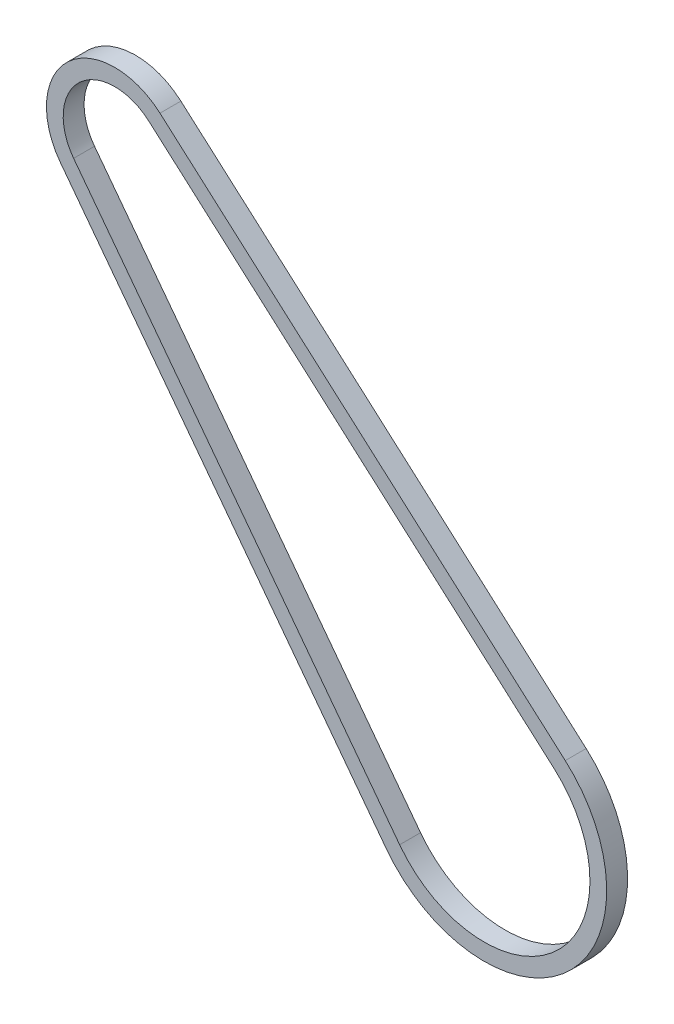
ISO-10303-21;
HEADER;
FILE_DESCRIPTION(('STEP AP214'),'2;1');
FILE_NAME('part.step','',(''),(''),'','','');
FILE_SCHEMA(('AUTOMOTIVE_DESIGN { 1 0 10303 214 1 1 1 1 }'));
ENDSEC;
DATA;
#1=APPLICATION_CONTEXT('core data for automotive mechanical design processes');
#2=APPLICATION_PROTOCOL_DEFINITION('international standard','automotive_design',2000,#1);
#3=PRODUCT_CONTEXT('',#1,'mechanical');
#4=PRODUCT('Part','Part','',(#3));
#5=PRODUCT_RELATED_PRODUCT_CATEGORY('part','',(#4));
#6=PRODUCT_DEFINITION_FORMATION('','',#4);
#7=PRODUCT_DEFINITION_CONTEXT('part definition',#1,'design');
#8=PRODUCT_DEFINITION('design','',#6,#7);
#9=PRODUCT_DEFINITION_SHAPE('','',#8);
#10=(LENGTH_UNIT() NAMED_UNIT(*) SI_UNIT(.MILLI.,.METRE.));
#11=(NAMED_UNIT(*) PLANE_ANGLE_UNIT() SI_UNIT($,.RADIAN.));
#12=(NAMED_UNIT(*) SI_UNIT($,.STERADIAN.) SOLID_ANGLE_UNIT());
#13=UNCERTAINTY_MEASURE_WITH_UNIT(LENGTH_MEASURE(1.E-05),#10,'distance_accuracy_value','');
#14=(GEOMETRIC_REPRESENTATION_CONTEXT(3) GLOBAL_UNCERTAINTY_ASSIGNED_CONTEXT((#13)) GLOBAL_UNIT_ASSIGNED_CONTEXT((#10,
#11,#12)) REPRESENTATION_CONTEXT('',''));
#15=CARTESIAN_POINT('',(0.,0.,0.));
#16=DIRECTION('',(0.,0.,1.));
#17=DIRECTION('',(1.,0.,0.));
#18=AXIS2_PLACEMENT_3D('',#15,#16,#17);
#19=CARTESIAN_POINT('',(-5.15972256683298,5.12057772172186,6.35));
#20=DIRECTION('',(0.,0.,1.));
#21=DIRECTION('',(1.,0.,0.));
#22=AXIS2_PLACEMENT_3D('',#19,#20,#21);
#23=PLANE('',#22);
#24=CARTESIAN_POINT('',(-5.15972256683298,5.12057772172186,6.35));
#25=DIRECTION('',(0.,0.,1.));
#26=DIRECTION('',(1.,0.,0.));
#27=AXIS2_PLACEMENT_3D('',#24,#25,#26);
#28=CIRCLE('',#27,37.236935850276);
#29=CARTESIAN_POINT('',(-34.8684238112249,-17.3289759907472,6.35));
#30=VERTEX_POINT('',#29);
#31=CARTESIAN_POINT('',(19.4938777779717,33.0273758461255,6.35));
#32=VERTEX_POINT('',#31);
#33=EDGE_CURVE('E134',#30,#32,#28,.T.);
#34=ORIENTED_EDGE('',*,*,#33,.T.);
#35=DIRECTION('',(-0.749438628264489,0.66207381949828,0.));
#36=VECTOR('',#35,1.);
#37=CARTESIAN_POINT('',(19.4938777779717,33.0273758461255,6.35));
#38=LINE('',#37,#36);
#39=CARTESIAN_POINT('',(-103.619658826307,141.789116084006,6.35));
#40=VERTEX_POINT('',#39);
#41=EDGE_CURVE('E137',#32,#40,#38,.T.);
#42=ORIENTED_EDGE('',*,*,#41,.T.);
#43=CARTESIAN_POINT('',(-117.355042285618,126.241262302031,6.35));
#44=DIRECTION('',(0.,0.,1.));
#45=DIRECTION('',(1.,0.,0.));
#46=AXIS2_PLACEMENT_3D('',#43,#44,#45);
#47=CIRCLE('',#46,20.746);
#48=CARTESIAN_POINT('',(-133.906799350011,113.733830348136,6.35));
#49=VERTEX_POINT('',#48);
#50=EDGE_CURVE('E140',#40,#49,#47,.T.);
#51=ORIENTED_EDGE('',*,*,#50,.T.);
#52=DIRECTION('',(0.602884023613954,-0.797828837577991,0.));
#53=VECTOR('',#52,1.);
#54=CARTESIAN_POINT('',(-34.8684238112249,-17.3289759907472,6.35));
#55=LINE('',#54,#53);
#56=EDGE_CURVE('E142',#49,#30,#55,.T.);
#57=ORIENTED_EDGE('',*,*,#56,.T.);
#58=EDGE_LOOP('',(#34,#42,#51,#57));
#59=FACE_BOUND('',#58,.T.);
#60=DIRECTION('',(-0.749438628264489,0.66207381949828,0.));
#61=VECTOR('',#60,1.);
#62=CARTESIAN_POINT('',(16.1305427749204,29.2202276145419,6.35));
#63=LINE('',#62,#61);
#64=CARTESIAN_POINT('',(16.1305427749204,29.2202276145419,6.35));
#65=VERTEX_POINT('',#64);
#66=CARTESIAN_POINT('',(-106.982993829358,137.981967852422,6.35));
#67=VERTEX_POINT('',#66);
#68=EDGE_CURVE('E106',#65,#67,#63,.T.);
#69=ORIENTED_EDGE('',*,*,#68,.F.);
#70=CARTESIAN_POINT('',(-5.15972256683298,5.12057772172186,6.35));
#71=DIRECTION('',(0.,0.,1.));
#72=DIRECTION('',(1.,0.,0.));
#73=AXIS2_PLACEMENT_3D('',#70,#71,#72);
#74=CIRCLE('',#73,32.156935850276);
#75=CARTESIAN_POINT('',(-30.8154533163287,-14.2663251507884,6.35));
#76=VERTEX_POINT('',#75);
#77=EDGE_CURVE('E98',#76,#65,#74,.T.);
#78=ORIENTED_EDGE('',*,*,#77,.F.);
#79=DIRECTION('',(0.602884023613954,-0.797828837577992,0.));
#80=VECTOR('',#79,1.);
#81=CARTESIAN_POINT('',(-30.8154533163287,-14.2663251507884,6.35));
#82=LINE('',#81,#80);
#83=CARTESIAN_POINT('',(-129.853828855115,116.796481188095,6.35));
#84=VERTEX_POINT('',#83);
#85=EDGE_CURVE('E120',#84,#76,#82,.T.);
#86=ORIENTED_EDGE('',*,*,#85,.F.);
#87=CARTESIAN_POINT('',(-117.355042285618,126.241262302031,6.35));
#88=DIRECTION('',(0.,0.,1.));
#89=DIRECTION('',(1.,0.,0.));
#90=AXIS2_PLACEMENT_3D('',#87,#88,#89);
#91=CIRCLE('',#90,15.666);
#92=EDGE_CURVE('E118',#67,#84,#91,.T.);
#93=ORIENTED_EDGE('',*,*,#92,.F.);
#94=EDGE_LOOP('',(#69,#78,#86,#93));
#95=FACE_BOUND('',#94,.T.);
#96=ADVANCED_FACE('F33',(#59,#95),#23,.T.);
#97=CARTESIAN_POINT('',(-5.15972256683298,5.12057772172186,0.));
#98=DIRECTION('',(0.,0.,1.));
#99=DIRECTION('',(1.,0.,0.));
#100=AXIS2_PLACEMENT_3D('',#97,#98,#99);
#101=PLANE('',#100);
#102=CARTESIAN_POINT('',(-5.15972256683298,5.12057772172186,0.));
#103=DIRECTION('',(0.,0.,1.));
#104=DIRECTION('',(1.,0.,0.));
#105=AXIS2_PLACEMENT_3D('',#102,#103,#104);
#106=CIRCLE('',#105,37.236935850276);
#107=CARTESIAN_POINT('',(-34.8684238112249,-17.3289759907472,0.));
#108=VERTEX_POINT('',#107);
#109=CARTESIAN_POINT('',(19.4938777779717,33.0273758461255,0.));
#110=VERTEX_POINT('',#109);
#111=EDGE_CURVE('E114',#108,#110,#106,.T.);
#112=ORIENTED_EDGE('',*,*,#111,.F.);
#113=DIRECTION('',(0.602884023613954,-0.797828837577991,0.));
#114=VECTOR('',#113,1.);
#115=CARTESIAN_POINT('',(-34.8684238112249,-17.3289759907472,0.));
#116=LINE('',#115,#114);
#117=CARTESIAN_POINT('',(-133.906799350011,113.733830348136,0.));
#118=VERTEX_POINT('',#117);
#119=EDGE_CURVE('E138',#118,#108,#116,.T.);
#120=ORIENTED_EDGE('',*,*,#119,.F.);
#121=CARTESIAN_POINT('',(-117.355042285618,126.241262302031,0.));
#122=DIRECTION('',(0.,0.,1.));
#123=DIRECTION('',(1.,0.,0.));
#124=AXIS2_PLACEMENT_3D('',#121,#122,#123);
#125=CIRCLE('',#124,20.746);
#126=CARTESIAN_POINT('',(-103.619658826307,141.789116084006,0.));
#127=VERTEX_POINT('',#126);
#128=EDGE_CURVE('E149',#127,#118,#125,.T.);
#129=ORIENTED_EDGE('',*,*,#128,.F.);
#130=DIRECTION('',(-0.749438628264489,0.66207381949828,0.));
#131=VECTOR('',#130,1.);
#132=CARTESIAN_POINT('',(19.4938777779717,33.0273758461255,0.));
#133=LINE('',#132,#131);
#134=EDGE_CURVE('E147',#110,#127,#133,.T.);
#135=ORIENTED_EDGE('',*,*,#134,.F.);
#136=EDGE_LOOP('',(#112,#120,#129,#135));
#137=FACE_BOUND('',#136,.T.);
#138=CARTESIAN_POINT('',(-5.15972256683298,5.12057772172186,0.));
#139=DIRECTION('',(0.,0.,1.));
#140=DIRECTION('',(1.,0.,0.));
#141=AXIS2_PLACEMENT_3D('',#138,#139,#140);
#142=CIRCLE('',#141,32.156935850276);
#143=CARTESIAN_POINT('',(-30.8154533163287,-14.2663251507884,0.));
#144=VERTEX_POINT('',#143);
#145=CARTESIAN_POINT('',(16.1305427749204,29.2202276145419,0.));
#146=VERTEX_POINT('',#145);
#147=EDGE_CURVE('E56',#144,#146,#142,.T.);
#148=ORIENTED_EDGE('',*,*,#147,.T.);
#149=DIRECTION('',(-0.749438628264489,0.66207381949828,0.));
#150=VECTOR('',#149,1.);
#151=CARTESIAN_POINT('',(16.1305427749204,29.2202276145419,0.));
#152=LINE('',#151,#150);
#153=CARTESIAN_POINT('',(-106.982993829358,137.981967852422,0.));
#154=VERTEX_POINT('',#153);
#155=EDGE_CURVE('E113',#146,#154,#152,.T.);
#156=ORIENTED_EDGE('',*,*,#155,.T.);
#157=CARTESIAN_POINT('',(-117.355042285618,126.241262302031,0.));
#158=DIRECTION('',(0.,0.,1.));
#159=DIRECTION('',(1.,0.,0.));
#160=AXIS2_PLACEMENT_3D('',#157,#158,#159);
#161=CIRCLE('',#160,15.666);
#162=CARTESIAN_POINT('',(-129.853828855115,116.796481188095,0.));
#163=VERTEX_POINT('',#162);
#164=EDGE_CURVE('E126',#154,#163,#161,.T.);
#165=ORIENTED_EDGE('',*,*,#164,.T.);
#166=DIRECTION('',(0.602884023613954,-0.797828837577992,0.));
#167=VECTOR('',#166,1.);
#168=CARTESIAN_POINT('',(-30.8154533163287,-14.2663251507884,0.));
#169=LINE('',#168,#167);
#170=EDGE_CURVE('E107',#163,#144,#169,.T.);
#171=ORIENTED_EDGE('',*,*,#170,.T.);
#172=EDGE_LOOP('',(#148,#156,#165,#171));
#173=FACE_BOUND('',#172,.T.);
#174=ADVANCED_FACE('F167',(#137,#173),#101,.F.);
#175=CARTESIAN_POINT('',(-5.15972256683298,5.12057772172186,6.35));
#176=DIRECTION('',(0.,0.,-1.));
#177=DIRECTION('',(-1.,0.,0.));
#178=AXIS2_PLACEMENT_3D('',#175,#176,#177);
#179=CYLINDRICAL_SURFACE('',#178,37.236935850276);
#180=ORIENTED_EDGE('',*,*,#111,.T.);
#181=DIRECTION('',(0.,0.,-1.));
#182=VECTOR('',#181,1.);
#183=CARTESIAN_POINT('',(19.4938777779717,33.0273758461255,6.35));
#184=LINE('',#183,#182);
#185=EDGE_CURVE('E11',#32,#110,#184,.T.);
#186=ORIENTED_EDGE('',*,*,#185,.F.);
#187=ORIENTED_EDGE('',*,*,#33,.F.);
#188=DIRECTION('',(0.,0.,-1.));
#189=VECTOR('',#188,1.);
#190=CARTESIAN_POINT('',(-34.8684238112249,-17.3289759907472,6.35));
#191=LINE('',#190,#189);
#192=EDGE_CURVE('E144',#30,#108,#191,.T.);
#193=ORIENTED_EDGE('',*,*,#192,.T.);
#194=EDGE_LOOP('',(#180,#186,#187,#193));
#195=FACE_BOUND('',#194,.T.);
#196=ADVANCED_FACE('F35',(#195),#179,.T.);
#197=CARTESIAN_POINT('',(19.4938777779717,33.0273758461255,6.35));
#198=DIRECTION('',(-0.66207381949828,-0.749438628264489,0.));
#199=DIRECTION('',(0.749438628264489,-0.66207381949828,0.));
#200=AXIS2_PLACEMENT_3D('',#197,#198,#199);
#201=PLANE('',#200);
#202=ORIENTED_EDGE('',*,*,#134,.T.);
#203=DIRECTION('',(0.,0.,-1.));
#204=VECTOR('',#203,1.);
#205=CARTESIAN_POINT('',(-103.619658826307,141.789116084006,6.35));
#206=LINE('',#205,#204);
#207=EDGE_CURVE('E41',#40,#127,#206,.T.);
#208=ORIENTED_EDGE('',*,*,#207,.F.);
#209=ORIENTED_EDGE('',*,*,#41,.F.);
#210=ORIENTED_EDGE('',*,*,#185,.T.);
#211=EDGE_LOOP('',(#202,#208,#209,#210));
#212=FACE_BOUND('',#211,.T.);
#213=ADVANCED_FACE('F177',(#212),#201,.F.);
#214=CARTESIAN_POINT('',(-117.355042285618,126.241262302031,6.35));
#215=DIRECTION('',(0.,0.,-1.));
#216=DIRECTION('',(-1.,0.,0.));
#217=AXIS2_PLACEMENT_3D('',#214,#215,#216);
#218=CYLINDRICAL_SURFACE('',#217,20.746);
#219=ORIENTED_EDGE('',*,*,#128,.T.);
#220=DIRECTION('',(0.,0.,-1.));
#221=VECTOR('',#220,1.);
#222=CARTESIAN_POINT('',(-133.906799350011,113.733830348136,6.35));
#223=LINE('',#222,#221);
#224=EDGE_CURVE('E154',#49,#118,#223,.T.);
#225=ORIENTED_EDGE('',*,*,#224,.F.);
#226=ORIENTED_EDGE('',*,*,#50,.F.);
#227=ORIENTED_EDGE('',*,*,#207,.T.);
#228=EDGE_LOOP('',(#219,#225,#226,#227));
#229=FACE_BOUND('',#228,.T.);
#230=ADVANCED_FACE('F161',(#229),#218,.T.);
#231=CARTESIAN_POINT('',(-34.8684238112249,-17.3289759907472,6.35));
#232=DIRECTION('',(0.797828837577992,0.602884023613954,0.));
#233=DIRECTION('',(-0.602884023613954,0.797828837577992,0.));
#234=AXIS2_PLACEMENT_3D('',#231,#232,#233);
#235=PLANE('',#234);
#236=ORIENTED_EDGE('',*,*,#119,.T.);
#237=ORIENTED_EDGE('',*,*,#192,.F.);
#238=ORIENTED_EDGE('',*,*,#56,.F.);
#239=ORIENTED_EDGE('',*,*,#224,.T.);
#240=EDGE_LOOP('',(#236,#237,#238,#239));
#241=FACE_BOUND('',#240,.T.);
#242=ADVANCED_FACE('F171',(#241),#235,.F.);
#243=CARTESIAN_POINT('',(-5.15972256683298,5.12057772172186,6.35));
#244=DIRECTION('',(0.,0.,-1.));
#245=DIRECTION('',(-1.,0.,0.));
#246=AXIS2_PLACEMENT_3D('',#243,#244,#245);
#247=CYLINDRICAL_SURFACE('',#246,32.156935850276);
#248=ORIENTED_EDGE('',*,*,#147,.F.);
#249=DIRECTION('',(0.,0.,-1.));
#250=VECTOR('',#249,1.);
#251=CARTESIAN_POINT('',(-30.8154533163287,-14.2663251507884,6.35));
#252=LINE('',#251,#250);
#253=EDGE_CURVE('E102',#76,#144,#252,.T.);
#254=ORIENTED_EDGE('',*,*,#253,.F.);
#255=ORIENTED_EDGE('',*,*,#77,.T.);
#256=DIRECTION('',(0.,0.,-1.));
#257=VECTOR('',#256,1.);
#258=CARTESIAN_POINT('',(16.1305427749204,29.2202276145419,6.35));
#259=LINE('',#258,#257);
#260=EDGE_CURVE('E101',#65,#146,#259,.T.);
#261=ORIENTED_EDGE('',*,*,#260,.T.);
#262=EDGE_LOOP('',(#248,#254,#255,#261));
#263=FACE_BOUND('',#262,.T.);
#264=ADVANCED_FACE('F100',(#263),#247,.F.);
#265=CARTESIAN_POINT('',(16.1305427749204,29.2202276145419,6.35));
#266=DIRECTION('',(-0.66207381949828,-0.749438628264489,0.));
#267=DIRECTION('',(0.749438628264489,-0.66207381949828,0.));
#268=AXIS2_PLACEMENT_3D('',#265,#266,#267);
#269=PLANE('',#268);
#270=ORIENTED_EDGE('',*,*,#155,.F.);
#271=ORIENTED_EDGE('',*,*,#260,.F.);
#272=ORIENTED_EDGE('',*,*,#68,.T.);
#273=DIRECTION('',(0.,0.,-1.));
#274=VECTOR('',#273,1.);
#275=CARTESIAN_POINT('',(-106.982993829358,137.981967852422,6.35));
#276=LINE('',#275,#274);
#277=EDGE_CURVE('E115',#67,#154,#276,.T.);
#278=ORIENTED_EDGE('',*,*,#277,.T.);
#279=EDGE_LOOP('',(#270,#271,#272,#278));
#280=FACE_BOUND('',#279,.T.);
#281=ADVANCED_FACE('F110',(#280),#269,.T.);
#282=CARTESIAN_POINT('',(-117.355042285618,126.241262302031,6.35));
#283=DIRECTION('',(0.,0.,-1.));
#284=DIRECTION('',(-1.,0.,0.));
#285=AXIS2_PLACEMENT_3D('',#282,#283,#284);
#286=CYLINDRICAL_SURFACE('',#285,15.666);
#287=ORIENTED_EDGE('',*,*,#164,.F.);
#288=ORIENTED_EDGE('',*,*,#277,.F.);
#289=ORIENTED_EDGE('',*,*,#92,.T.);
#290=DIRECTION('',(0.,0.,-1.));
#291=VECTOR('',#290,1.);
#292=CARTESIAN_POINT('',(-129.853828855115,116.796481188095,6.35));
#293=LINE('',#292,#291);
#294=EDGE_CURVE('E48',#84,#163,#293,.T.);
#295=ORIENTED_EDGE('',*,*,#294,.T.);
#296=EDGE_LOOP('',(#287,#288,#289,#295));
#297=FACE_BOUND('',#296,.T.);
#298=ADVANCED_FACE('F200',(#297),#286,.F.);
#299=CARTESIAN_POINT('',(-30.8154533163287,-14.2663251507884,6.35));
#300=DIRECTION('',(0.797828837577992,0.602884023613954,0.));
#301=DIRECTION('',(-0.602884023613954,0.797828837577992,0.));
#302=AXIS2_PLACEMENT_3D('',#299,#300,#301);
#303=PLANE('',#302);
#304=ORIENTED_EDGE('',*,*,#170,.F.);
#305=ORIENTED_EDGE('',*,*,#294,.F.);
#306=ORIENTED_EDGE('',*,*,#85,.T.);
#307=ORIENTED_EDGE('',*,*,#253,.T.);
#308=EDGE_LOOP('',(#304,#305,#306,#307));
#309=FACE_BOUND('',#308,.T.);
#310=ADVANCED_FACE('F204',(#309),#303,.T.);
#311=CLOSED_SHELL('',(#96,#174,#196,#213,#230,#242,#264,#281,#298,#310));
#312=MANIFOLD_SOLID_BREP('B2',#311);
#313=ADVANCED_BREP_SHAPE_REPRESENTATION('',(#18,#312),#14);
#314=SHAPE_DEFINITION_REPRESENTATION(#9,#313);
ENDSEC;
END-ISO-10303-21;
